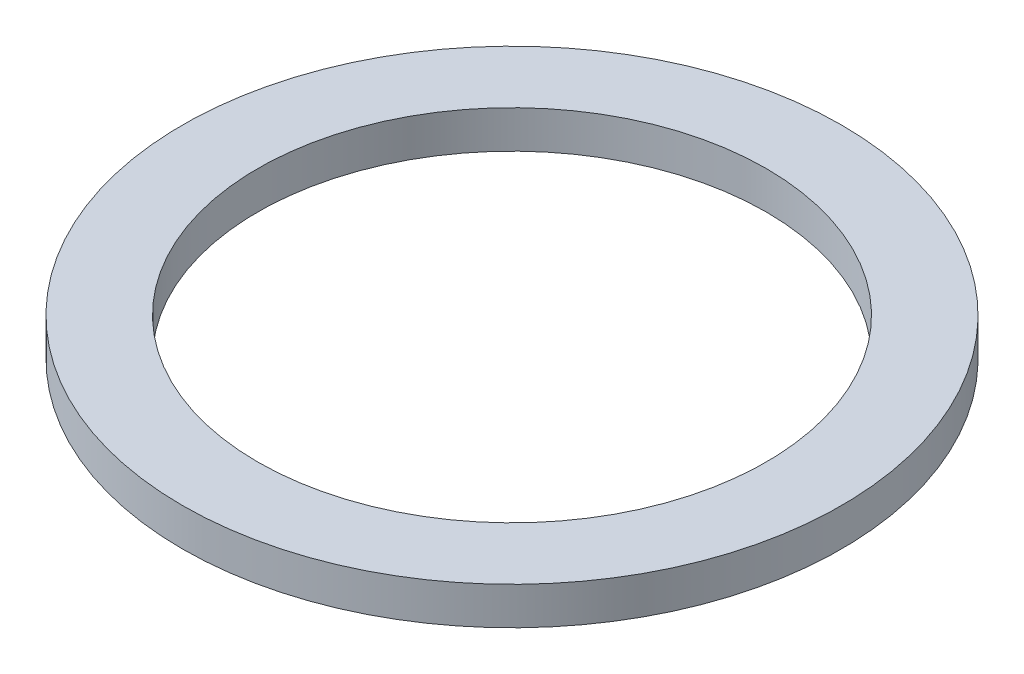
ISO-10303-21;
HEADER;
FILE_DESCRIPTION(('STEP AP214'),'2;1');
FILE_NAME('part.step','',(''),(''),'','','');
FILE_SCHEMA(('AUTOMOTIVE_DESIGN { 1 0 10303 214 1 1 1 1 }'));
ENDSEC;
DATA;
#1=APPLICATION_CONTEXT('core data for automotive mechanical design processes');
#2=APPLICATION_PROTOCOL_DEFINITION('international standard','automotive_design',2000,#1);
#3=PRODUCT_CONTEXT('',#1,'mechanical');
#4=PRODUCT('Part','Part','',(#3));
#5=PRODUCT_RELATED_PRODUCT_CATEGORY('part','',(#4));
#6=PRODUCT_DEFINITION_FORMATION('','',#4);
#7=PRODUCT_DEFINITION_CONTEXT('part definition',#1,'design');
#8=PRODUCT_DEFINITION('design','',#6,#7);
#9=PRODUCT_DEFINITION_SHAPE('','',#8);
#10=(LENGTH_UNIT() NAMED_UNIT(*) SI_UNIT(.MILLI.,.METRE.));
#11=(NAMED_UNIT(*) PLANE_ANGLE_UNIT() SI_UNIT($,.RADIAN.));
#12=(NAMED_UNIT(*) SI_UNIT($,.STERADIAN.) SOLID_ANGLE_UNIT());
#13=UNCERTAINTY_MEASURE_WITH_UNIT(LENGTH_MEASURE(1.E-05),#10,'distance_accuracy_value','');
#14=(GEOMETRIC_REPRESENTATION_CONTEXT(3) GLOBAL_UNCERTAINTY_ASSIGNED_CONTEXT((#13)) GLOBAL_UNIT_ASSIGNED_CONTEXT((#10,
#11,#12)) REPRESENTATION_CONTEXT('',''));
#15=CARTESIAN_POINT('',(0.,0.,0.));
#16=DIRECTION('',(0.,0.,1.));
#17=DIRECTION('',(1.,0.,0.));
#18=AXIS2_PLACEMENT_3D('',#15,#16,#17);
#19=CARTESIAN_POINT('',(0.,0.508,0.));
#20=DIRECTION('',(0.,1.,0.));
#21=DIRECTION('',(0.,0.,1.));
#22=AXIS2_PLACEMENT_3D('',#19,#20,#21);
#23=PLANE('',#22);
#24=CARTESIAN_POINT('',(0.,0.508,0.));
#25=DIRECTION('',(0.,1.,0.));
#26=DIRECTION('',(0.,0.,1.));
#27=AXIS2_PLACEMENT_3D('',#24,#25,#26);
#28=CIRCLE('',#27,4.445);
#29=CARTESIAN_POINT('',(0.,0.508,4.445));
#30=VERTEX_POINT('',#29);
#31=EDGE_CURVE('E10',#30,#30,#28,.T.);
#32=ORIENTED_EDGE('',*,*,#31,.T.);
#33=EDGE_LOOP('',(#32));
#34=FACE_BOUND('',#33,.T.);
#35=CARTESIAN_POINT('',(0.,0.508,0.));
#36=DIRECTION('',(0.,1.,0.));
#37=DIRECTION('',(0.,0.,1.));
#38=AXIS2_PLACEMENT_3D('',#35,#36,#37);
#39=CIRCLE('',#38,3.429);
#40=CARTESIAN_POINT('',(0.,0.508,3.429));
#41=VERTEX_POINT('',#40);
#42=EDGE_CURVE('E41',#41,#41,#39,.T.);
#43=ORIENTED_EDGE('',*,*,#42,.F.);
#44=EDGE_LOOP('',(#43));
#45=FACE_BOUND('',#44,.T.);
#46=ADVANCED_FACE('F30',(#34,#45),#23,.T.);
#47=CARTESIAN_POINT('',(0.,0.,0.));
#48=DIRECTION('',(0.,1.,0.));
#49=DIRECTION('',(0.,0.,1.));
#50=AXIS2_PLACEMENT_3D('',#47,#48,#49);
#51=PLANE('',#50);
#52=CARTESIAN_POINT('',(0.,0.,0.));
#53=DIRECTION('',(0.,1.,0.));
#54=DIRECTION('',(0.,0.,1.));
#55=AXIS2_PLACEMENT_3D('',#52,#53,#54);
#56=CIRCLE('',#55,4.445);
#57=CARTESIAN_POINT('',(0.,0.,4.445));
#58=VERTEX_POINT('',#57);
#59=EDGE_CURVE('E34',#58,#58,#56,.T.);
#60=ORIENTED_EDGE('',*,*,#59,.F.);
#61=EDGE_LOOP('',(#60));
#62=FACE_BOUND('',#61,.T.);
#63=CARTESIAN_POINT('',(0.,0.,0.));
#64=DIRECTION('',(0.,1.,0.));
#65=DIRECTION('',(0.,0.,1.));
#66=AXIS2_PLACEMENT_3D('',#63,#64,#65);
#67=CIRCLE('',#66,3.429);
#68=CARTESIAN_POINT('',(0.,0.,3.429));
#69=VERTEX_POINT('',#68);
#70=EDGE_CURVE('E43',#69,#69,#67,.T.);
#71=ORIENTED_EDGE('',*,*,#70,.T.);
#72=EDGE_LOOP('',(#71));
#73=FACE_BOUND('',#72,.T.);
#74=ADVANCED_FACE('F53',(#62,#73),#51,.F.);
#75=CARTESIAN_POINT('',(0.,0.508,0.));
#76=DIRECTION('',(0.,-1.,0.));
#77=DIRECTION('',(0.,0.,-1.));
#78=AXIS2_PLACEMENT_3D('',#75,#76,#77);
#79=CYLINDRICAL_SURFACE('',#78,4.445);
#80=ORIENTED_EDGE('',*,*,#31,.F.);
#81=EDGE_LOOP('',(#80));
#82=FACE_BOUND('',#81,.T.);
#83=ORIENTED_EDGE('',*,*,#59,.T.);
#84=EDGE_LOOP('',(#83));
#85=FACE_BOUND('',#84,.T.);
#86=ADVANCED_FACE('F32',(#82,#85),#79,.T.);
#87=CARTESIAN_POINT('',(0.,0.508,0.));
#88=DIRECTION('',(0.,-1.,0.));
#89=DIRECTION('',(0.,0.,-1.));
#90=AXIS2_PLACEMENT_3D('',#87,#88,#89);
#91=CYLINDRICAL_SURFACE('',#90,3.429);
#92=ORIENTED_EDGE('',*,*,#42,.T.);
#93=EDGE_LOOP('',(#92));
#94=FACE_BOUND('',#93,.T.);
#95=ORIENTED_EDGE('',*,*,#70,.F.);
#96=EDGE_LOOP('',(#95));
#97=FACE_BOUND('',#96,.T.);
#98=ADVANCED_FACE('F49',(#94,#97),#91,.F.);
#99=CLOSED_SHELL('',(#46,#74,#86,#98));
#100=MANIFOLD_SOLID_BREP('B2',#99);
#101=ADVANCED_BREP_SHAPE_REPRESENTATION('',(#18,#100),#14);
#102=SHAPE_DEFINITION_REPRESENTATION(#9,#101);
ENDSEC;
END-ISO-10303-21;
